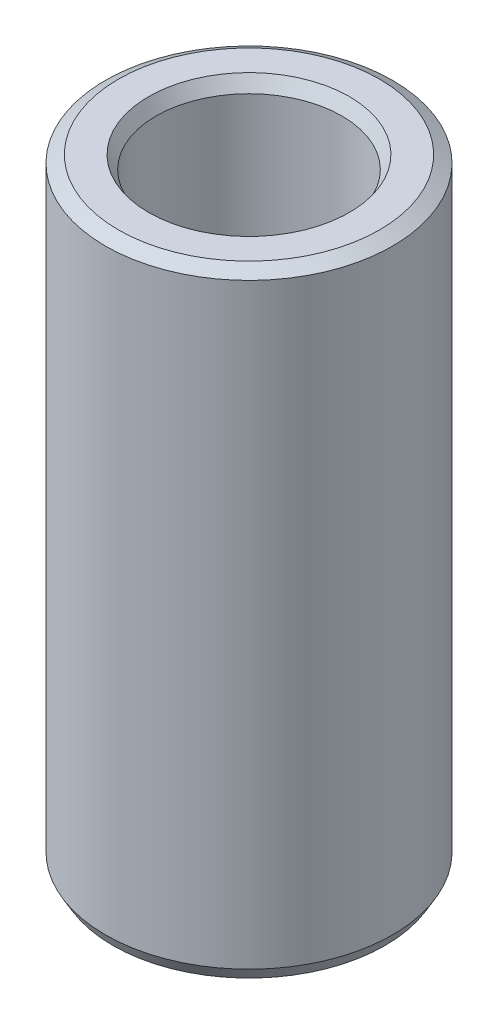
ISO-10303-21;
HEADER;
FILE_DESCRIPTION(('STEP AP214'),'2;1');
FILE_NAME('part.step','',(''),(''),'','','');
FILE_SCHEMA(('AUTOMOTIVE_DESIGN { 1 0 10303 214 1 1 1 1 }'));
ENDSEC;
DATA;
#1=APPLICATION_CONTEXT('core data for automotive mechanical design processes');
#2=APPLICATION_PROTOCOL_DEFINITION('international standard','automotive_design',2000,#1);
#3=PRODUCT_CONTEXT('',#1,'mechanical');
#4=PRODUCT('Part','Part','',(#3));
#5=PRODUCT_RELATED_PRODUCT_CATEGORY('part','',(#4));
#6=PRODUCT_DEFINITION_FORMATION('','',#4);
#7=PRODUCT_DEFINITION_CONTEXT('part definition',#1,'design');
#8=PRODUCT_DEFINITION('design','',#6,#7);
#9=PRODUCT_DEFINITION_SHAPE('','',#8);
#10=(LENGTH_UNIT() NAMED_UNIT(*) SI_UNIT(.MILLI.,.METRE.));
#11=(NAMED_UNIT(*) PLANE_ANGLE_UNIT() SI_UNIT($,.RADIAN.));
#12=(NAMED_UNIT(*) SI_UNIT($,.STERADIAN.) SOLID_ANGLE_UNIT());
#13=UNCERTAINTY_MEASURE_WITH_UNIT(LENGTH_MEASURE(1.E-05),#10,'distance_accuracy_value','');
#14=(GEOMETRIC_REPRESENTATION_CONTEXT(3) GLOBAL_UNCERTAINTY_ASSIGNED_CONTEXT((#13)) GLOBAL_UNIT_ASSIGNED_CONTEXT((#10,
#11,#12)) REPRESENTATION_CONTEXT('',''));
#15=CARTESIAN_POINT('',(0.,0.,0.));
#16=DIRECTION('',(0.,0.,1.));
#17=DIRECTION('',(1.,0.,0.));
#18=AXIS2_PLACEMENT_3D('',#15,#16,#17);
#19=CARTESIAN_POINT('',(0.,118.183043279811,0.));
#20=DIRECTION('',(0.,-1.,0.));
#21=DIRECTION('',(0.,0.,-1.));
#22=AXIS2_PLACEMENT_3D('',#19,#20,#21);
#23=CYLINDRICAL_SURFACE('',#22,27.5);
#24=CARTESIAN_POINT('',(0.,2.48997052485185,0.));
#25=DIRECTION('',(0.,1.,0.));
#26=DIRECTION('',(0.,0.,1.));
#27=AXIS2_PLACEMENT_3D('',#24,#25,#26);
#28=CIRCLE('',#27,27.5);
#29=CARTESIAN_POINT('',(0.,2.48997052485185,-27.5));
#30=VERTEX_POINT('',#29);
#31=EDGE_CURVE('E10',#30,#30,#28,.T.);
#32=CARTESIAN_POINT('',(0.,116.745458127014,0.));
#33=DIRECTION('',(0.,1.,0.));
#34=DIRECTION('',(0.,0.,1.));
#35=AXIS2_PLACEMENT_3D('',#32,#33,#34);
#36=CIRCLE('',#35,27.5);
#37=CARTESIAN_POINT('',(0.,116.745458127014,-27.5));
#38=VERTEX_POINT('',#37);
#39=EDGE_CURVE('E50',#38,#38,#36,.F.);
#40=CARTESIAN_POINT('',(0.,2.48997052485185,-27.5));
#41=CARTESIAN_POINT('',(0.,3.68013185404104,-27.5));
#42=CARTESIAN_POINT('',(0.,4.87029318323022,-27.5));
#43=CARTESIAN_POINT('',(0.,7.2506158416086,-27.5));
#44=CARTESIAN_POINT('',(0.,8.44077717079778,-27.5));
#45=CARTESIAN_POINT('',(0.,10.8210998291762,-27.5));
#46=CARTESIAN_POINT('',(0.,12.0112611583653,-27.5));
#47=CARTESIAN_POINT('',(0.,14.3915838167437,-27.5));
#48=CARTESIAN_POINT('',(0.,15.5817451459329,-27.5));
#49=CARTESIAN_POINT('',(0.,17.9620678043113,-27.5));
#50=CARTESIAN_POINT('',(0.,19.1522291335005,-27.5));
#51=CARTESIAN_POINT('',(0.,21.5325517918788,-27.5));
#52=CARTESIAN_POINT('',(0.,22.722713121068,-27.5));
#53=CARTESIAN_POINT('',(0.,25.1030357794464,-27.5));
#54=CARTESIAN_POINT('',(0.,26.2931971086356,-27.5));
#55=CARTESIAN_POINT('',(0.,28.673519767014,-27.5));
#56=CARTESIAN_POINT('',(0.,29.8636810962031,-27.5));
#57=CARTESIAN_POINT('',(0.,32.2440037545815,-27.5));
#58=CARTESIAN_POINT('',(0.,33.4341650837707,-27.5));
#59=CARTESIAN_POINT('',(0.,35.8144877421491,-27.5));
#60=CARTESIAN_POINT('',(0.,37.0046490713383,-27.5));
#61=CARTESIAN_POINT('',(0.,39.3849717297166,-27.5));
#62=CARTESIAN_POINT('',(0.,40.5751330589058,-27.5));
#63=CARTESIAN_POINT('',(0.,42.9554557172842,-27.5));
#64=CARTESIAN_POINT('',(0.,44.1456170464734,-27.5));
#65=CARTESIAN_POINT('',(0.,46.5259397048518,-27.5));
#66=CARTESIAN_POINT('',(0.,47.7161010340409,-27.5));
#67=CARTESIAN_POINT('',(0.,50.0964236924193,-27.5));
#68=CARTESIAN_POINT('',(0.,51.2865850216085,-27.5));
#69=CARTESIAN_POINT('',(0.,53.6669076799869,-27.5));
#70=CARTESIAN_POINT('',(0.,54.8570690091761,-27.5));
#71=CARTESIAN_POINT('',(0.,57.2373916675544,-27.5));
#72=CARTESIAN_POINT('',(0.,58.4275529967436,-27.5));
#73=CARTESIAN_POINT('',(0.,60.807875655122,-27.5));
#74=CARTESIAN_POINT('',(0.,61.9980369843112,-27.5));
#75=CARTESIAN_POINT('',(0.,64.3783596426895,-27.5));
#76=CARTESIAN_POINT('',(0.,65.5685209718788,-27.5));
#77=CARTESIAN_POINT('',(0.,67.9488436302571,-27.5));
#78=CARTESIAN_POINT('',(0.,69.1390049594463,-27.5));
#79=CARTESIAN_POINT('',(0.,71.5193276178247,-27.5));
#80=CARTESIAN_POINT('',(0.,72.7094889470139,-27.5));
#81=CARTESIAN_POINT('',(0.,75.0898116053922,-27.5));
#82=CARTESIAN_POINT('',(0.,76.2799729345814,-27.5));
#83=CARTESIAN_POINT('',(0.,78.6602955929598,-27.5));
#84=CARTESIAN_POINT('',(0.,79.850456922149,-27.5));
#85=CARTESIAN_POINT('',(0.,82.2307795805273,-27.5));
#86=CARTESIAN_POINT('',(0.,83.4209409097165,-27.5));
#87=CARTESIAN_POINT('',(0.,85.8012635680949,-27.5));
#88=CARTESIAN_POINT('',(0.,86.9914248972841,-27.5));
#89=CARTESIAN_POINT('',(0.,89.3717475556625,-27.5));
#90=CARTESIAN_POINT('',(0.,90.5619088848516,-27.5));
#91=CARTESIAN_POINT('',(0.,92.94223154323,-27.5));
#92=CARTESIAN_POINT('',(0.,94.1323928724192,-27.5));
#93=CARTESIAN_POINT('',(0.,96.5127155307976,-27.5));
#94=CARTESIAN_POINT('',(0.,97.7028768599868,-27.5));
#95=CARTESIAN_POINT('',(0.,100.083199518365,-27.5));
#96=CARTESIAN_POINT('',(0.,101.273360847554,-27.5));
#97=CARTESIAN_POINT('',(0.,103.653683505933,-27.5));
#98=CARTESIAN_POINT('',(0.,104.843844835122,-27.5));
#99=CARTESIAN_POINT('',(0.,107.2241674935,-27.5));
#100=CARTESIAN_POINT('',(0.,108.414328822689,-27.5));
#101=CARTESIAN_POINT('',(0.,110.794651481068,-27.5));
#102=CARTESIAN_POINT('',(0.,111.984812810257,-27.5));
#103=CARTESIAN_POINT('',(0.,114.365135468635,-27.5));
#104=CARTESIAN_POINT('',(0.,115.555296797825,-27.5));
#105=CARTESIAN_POINT('',(0.,116.745458127014,-27.5));
#106=B_SPLINE_CURVE_WITH_KNOTS('',3,(#40,#41,#42,#43,#44,#45,#46,#47,#48,#49,#50,#51,#52,#53,
#54,#55,#56,#57,#58,#59,#60,#61,#62,#63,#64,#65,#66,#67,#68,#69,#70,#71,#72,#73,#74,#75,#76,#77,
#78,#79,#80,#81,#82,#83,#84,#85,#86,#87,#88,#89,#90,#91,#92,#93,#94,#95,#96,#97,#98,#99,#100,
#101,#102,#103,#104,#105),.UNSPECIFIED.,.F.,.F.,(4,2,2,2,2,2,2,2,2,2,2,2,2,2,2,2,2,2,2,2,2,2,2,
2,2,2,2,2,2,2,2,2,4),(0.,3.57048398756755,7.14096797513512,10.7114519627027,14.2819359502702,
17.8524199378378,21.4229039254054,24.9933879129729,28.5638719005405,32.134355888108,
35.7048398756756,39.2753238632432,42.8458078508107,46.4162918383783,49.9867758259458,
53.5572598135134,57.127743801081,60.6982277886485,64.2687117762161,67.8391957637836,
71.4096797513512,74.9801637389188,78.5506477264863,82.1211317140539,85.6916157016214,
89.262099689189,92.8325836767566,96.4030676643241,99.9735516518917,103.544035639459,
107.114519627027,110.685003614594,114.255487602162),.UNSPECIFIED.);
#107=EDGE_CURVE('BSEAM39',#30,#38,#106,.T.);
#108=ORIENTED_EDGE('',*,*,#31,.T.);
#109=ORIENTED_EDGE('',*,*,#39,.T.);
#110=ORIENTED_EDGE('',*,*,#107,.T.);
#111=ORIENTED_EDGE('',*,*,#107,.F.);
#112=EDGE_LOOP('',(#108,#110,#109,#111));
#113=FACE_BOUND('',#112,.T.);
#114=ADVANCED_FACE('F39',(#113),#23,.T.);
#115=CARTESIAN_POINT('',(0.,118.183043279811,0.));
#116=DIRECTION('',(0.,1.,0.));
#117=DIRECTION('',(0.,0.,1.));
#118=AXIS2_PLACEMENT_3D('',#115,#116,#117);
#119=PLANE('',#118);
#120=CARTESIAN_POINT('',(0.,118.183043279811,0.));
#121=DIRECTION('',(0.,1.,0.));
#122=DIRECTION('',(0.,0.,1.));
#123=AXIS2_PLACEMENT_3D('',#120,#121,#122);
#124=CIRCLE('',#123,19.2276887024734);
#125=CARTESIAN_POINT('',(0.,118.183043279811,19.2276887024734));
#126=VERTEX_POINT('',#125);
#127=EDGE_CURVE('E58',#126,#126,#124,.F.);
#128=ORIENTED_EDGE('',*,*,#127,.T.);
#129=EDGE_LOOP('',(#128));
#130=FACE_BOUND('',#129,.T.);
#131=CARTESIAN_POINT('',(0.,118.183043279811,0.));
#132=DIRECTION('',(0.,1.,0.));
#133=DIRECTION('',(0.,0.,1.));
#134=AXIS2_PLACEMENT_3D('',#131,#132,#133);
#135=CIRCLE('',#134,25.0100294751485);
#136=CARTESIAN_POINT('',(0.,118.183043279811,25.0100294751485));
#137=VERTEX_POINT('',#136);
#138=EDGE_CURVE('E61',#137,#137,#135,.T.);
#139=ORIENTED_EDGE('',*,*,#138,.T.);
#140=EDGE_LOOP('',(#139));
#141=FACE_BOUND('',#140,.T.);
#142=ADVANCED_FACE('F88',(#130,#141),#119,.T.);
#143=CARTESIAN_POINT('',(0.,0.,0.));
#144=DIRECTION('',(0.,1.,0.));
#145=DIRECTION('',(0.,0.,1.));
#146=AXIS2_PLACEMENT_3D('',#143,#144,#145);
#147=PLANE('',#146);
#148=CARTESIAN_POINT('',(0.,0.,0.));
#149=DIRECTION('',(0.,1.,0.));
#150=DIRECTION('',(0.,0.,1.));
#151=AXIS2_PLACEMENT_3D('',#148,#149,#150);
#152=CIRCLE('',#151,20.2800740745276);
#153=CARTESIAN_POINT('',(0.,0.,20.2800740745276));
#154=VERTEX_POINT('',#153);
#155=EDGE_CURVE('E51',#154,#154,#152,.T.);
#156=ORIENTED_EDGE('',*,*,#155,.T.);
#157=EDGE_LOOP('',(#156));
#158=FACE_BOUND('',#157,.T.);
#159=CARTESIAN_POINT('',(0.,0.,0.));
#160=DIRECTION('',(0.,1.,0.));
#161=DIRECTION('',(0.,0.,1.));
#162=AXIS2_PLACEMENT_3D('',#159,#160,#161);
#163=CIRCLE('',#162,26.0624148472025);
#164=CARTESIAN_POINT('',(0.,0.,26.0624148472025));
#165=VERTEX_POINT('',#164);
#166=EDGE_CURVE('E54',#165,#165,#163,.F.);
#167=ORIENTED_EDGE('',*,*,#166,.T.);
#168=EDGE_LOOP('',(#167));
#169=FACE_BOUND('',#168,.T.);
#170=ADVANCED_FACE('F83',(#158,#169),#147,.F.);
#171=CARTESIAN_POINT('',(0.,118.183043279811,0.));
#172=DIRECTION('',(0.,-1.,0.));
#173=DIRECTION('',(0.,0.,-1.));
#174=AXIS2_PLACEMENT_3D('',#171,#172,#173);
#175=CYLINDRICAL_SURFACE('',#174,17.790103549676);
#176=CARTESIAN_POINT('',(0.,115.693072754959,0.));
#177=DIRECTION('',(0.,1.,0.));
#178=DIRECTION('',(0.,0.,1.));
#179=AXIS2_PLACEMENT_3D('',#176,#177,#178);
#180=CIRCLE('',#179,17.790103549676);
#181=CARTESIAN_POINT('',(0.,115.693072754959,-17.790103549676));
#182=VERTEX_POINT('',#181);
#183=EDGE_CURVE('E67',#182,#182,#180,.T.);
#184=CARTESIAN_POINT('',(0.,1.43758515279729,0.));
#185=DIRECTION('',(0.,1.,0.));
#186=DIRECTION('',(0.,0.,1.));
#187=AXIS2_PLACEMENT_3D('',#184,#185,#186);
#188=CIRCLE('',#187,17.790103549676);
#189=CARTESIAN_POINT('',(0.,1.43758515279728,-17.790103549676));
#190=VERTEX_POINT('',#189);
#191=EDGE_CURVE('E69',#190,#190,#188,.F.);
#192=CARTESIAN_POINT('',(0.,115.693072754959,-17.790103549676));
#193=CARTESIAN_POINT('',(0.,114.50291142577,-17.790103549676));
#194=CARTESIAN_POINT('',(0.,113.312750096581,-17.790103549676));
#195=CARTESIAN_POINT('',(0.,110.932427438203,-17.790103549676));
#196=CARTESIAN_POINT('',(0.,109.742266109013,-17.790103549676));
#197=CARTESIAN_POINT('',(0.,107.361943450635,-17.790103549676));
#198=CARTESIAN_POINT('',(0.,106.171782121446,-17.790103549676));
#199=CARTESIAN_POINT('',(0.,103.791459463067,-17.790103549676));
#200=CARTESIAN_POINT('',(0.,102.601298133878,-17.790103549676));
#201=CARTESIAN_POINT('',(0.,100.2209754755,-17.790103549676));
#202=CARTESIAN_POINT('',(0.,99.0308141463106,-17.790103549676));
#203=CARTESIAN_POINT('',(0.,96.6504914879323,-17.790103549676));
#204=CARTESIAN_POINT('',(0.,95.4603301587431,-17.790103549676));
#205=CARTESIAN_POINT('',(0.,93.0800075003647,-17.790103549676));
#206=CARTESIAN_POINT('',(0.,91.8898461711755,-17.790103549676));
#207=CARTESIAN_POINT('',(0.,89.5095235127971,-17.790103549676));
#208=CARTESIAN_POINT('',(0.,88.319362183608,-17.790103549676));
#209=CARTESIAN_POINT('',(0.,85.9390395252296,-17.790103549676));
#210=CARTESIAN_POINT('',(0.,84.7488781960404,-17.790103549676));
#211=CARTESIAN_POINT('',(0.,82.368555537662,-17.790103549676));
#212=CARTESIAN_POINT('',(0.,81.1783942084728,-17.790103549676));
#213=CARTESIAN_POINT('',(0.,78.7980715500944,-17.790103549676));
#214=CARTESIAN_POINT('',(0.,77.6079102209053,-17.790103549676));
#215=CARTESIAN_POINT('',(0.,75.2275875625269,-17.790103549676));
#216=CARTESIAN_POINT('',(0.,74.0374262333377,-17.790103549676));
#217=CARTESIAN_POINT('',(0.,71.6571035749594,-17.790103549676));
#218=CARTESIAN_POINT('',(0.,70.4669422457701,-17.790103549676));
#219=CARTESIAN_POINT('',(0.,68.0866195873918,-17.790103549676));
#220=CARTESIAN_POINT('',(0.,66.8964582582026,-17.790103549676));
#221=CARTESIAN_POINT('',(0.,64.5161355998242,-17.790103549676));
#222=CARTESIAN_POINT('',(0.,63.325974270635,-17.790103549676));
#223=CARTESIAN_POINT('',(0.,60.9456516122567,-17.790103549676));
#224=CARTESIAN_POINT('',(0.,59.7554902830675,-17.790103549676));
#225=CARTESIAN_POINT('',(0.,57.3751676246891,-17.790103549676));
#226=CARTESIAN_POINT('',(0.,56.1850062954999,-17.790103549676));
#227=CARTESIAN_POINT('',(0.,53.8046836371215,-17.790103549676));
#228=CARTESIAN_POINT('',(0.,52.6145223079323,-17.790103549676));
#229=CARTESIAN_POINT('',(0.,50.234199649554,-17.790103549676));
#230=CARTESIAN_POINT('',(0.,49.0440383203648,-17.790103549676));
#231=CARTESIAN_POINT('',(0.,46.6637156619864,-17.790103549676));
#232=CARTESIAN_POINT('',(0.,45.4735543327972,-17.790103549676));
#233=CARTESIAN_POINT('',(0.,43.0932316744188,-17.790103549676));
#234=CARTESIAN_POINT('',(0.,41.9030703452297,-17.790103549676));
#235=CARTESIAN_POINT('',(0.,39.5227476868513,-17.790103549676));
#236=CARTESIAN_POINT('',(0.,38.3325863576621,-17.790103549676));
#237=CARTESIAN_POINT('',(0.,35.9522636992837,-17.790103549676));
#238=CARTESIAN_POINT('',(0.,34.7621023700945,-17.790103549676));
#239=CARTESIAN_POINT('',(0.,32.3817797117161,-17.790103549676));
#240=CARTESIAN_POINT('',(0.,31.191618382527,-17.790103549676));
#241=CARTESIAN_POINT('',(0.,28.8112957241486,-17.790103549676));
#242=CARTESIAN_POINT('',(0.,27.6211343949594,-17.790103549676));
#243=CARTESIAN_POINT('',(0.,25.240811736581,-17.790103549676));
#244=CARTESIAN_POINT('',(0.,24.0506504073918,-17.790103549676));
#245=CARTESIAN_POINT('',(0.,21.6703277490135,-17.790103549676));
#246=CARTESIAN_POINT('',(0.,20.4801664198243,-17.790103549676));
#247=CARTESIAN_POINT('',(0.,18.0998437614459,-17.790103549676));
#248=CARTESIAN_POINT('',(0.,16.9096824322567,-17.790103549676));
#249=CARTESIAN_POINT('',(0.,14.5293597738783,-17.790103549676));
#250=CARTESIAN_POINT('',(0.,13.3391984446892,-17.790103549676));
#251=CARTESIAN_POINT('',(0.,10.9588757863108,-17.790103549676));
#252=CARTESIAN_POINT('',(0.,9.76871445712159,-17.790103549676));
#253=CARTESIAN_POINT('',(0.,7.38839179874322,-17.790103549676));
#254=CARTESIAN_POINT('',(0.,6.19823046955403,-17.790103549676));
#255=CARTESIAN_POINT('',(0.,3.81790781117566,-17.790103549676));
#256=CARTESIAN_POINT('',(0.,2.62774648198647,-17.790103549676));
#257=CARTESIAN_POINT('',(0.,1.43758515279728,-17.790103549676));
#258=B_SPLINE_CURVE_WITH_KNOTS('',3,(#192,#193,#194,#195,#196,#197,#198,#199,#200,#201,#202,
#203,#204,#205,#206,#207,#208,#209,#210,#211,#212,#213,#214,#215,#216,#217,#218,#219,#220,#221,
#222,#223,#224,#225,#226,#227,#228,#229,#230,#231,#232,#233,#234,#235,#236,#237,#238,#239,#240,
#241,#242,#243,#244,#245,#246,#247,#248,#249,#250,#251,#252,#253,#254,#255,#256,#257),
.UNSPECIFIED.,.F.,.F.,(4,2,2,2,2,2,2,2,2,2,2,2,2,2,2,2,2,2,2,2,2,2,2,2,2,2,2,2,2,2,2,2,4),(0.,
3.57048398756755,7.14096797513512,10.7114519627027,14.2819359502702,17.8524199378378,
21.4229039254054,24.9933879129729,28.5638719005405,32.134355888108,35.7048398756756,
39.2753238632432,42.8458078508107,46.4162918383783,49.9867758259459,53.5572598135134,
57.127743801081,60.6982277886485,64.2687117762161,67.8391957637837,71.4096797513512,
74.9801637389188,78.5506477264864,82.1211317140539,85.6916157016215,89.262099689189,
92.8325836767566,96.4030676643242,99.9735516518917,103.544035639459,107.114519627027,
110.685003614594,114.255487602162),.UNSPECIFIED.);
#259=EDGE_CURVE('BSEAM71',#182,#190,#258,.T.);
#260=ORIENTED_EDGE('',*,*,#183,.T.);
#261=ORIENTED_EDGE('',*,*,#191,.T.);
#262=ORIENTED_EDGE('',*,*,#259,.T.);
#263=ORIENTED_EDGE('',*,*,#259,.F.);
#264=EDGE_LOOP('',(#260,#262,#261,#263));
#265=FACE_BOUND('',#264,.T.);
#266=ADVANCED_FACE('F71',(#265),#175,.F.);
#267=CARTESIAN_POINT('',(0.,115.693072754959,0.));
#268=DIRECTION('',(0.,1.,0.));
#269=DIRECTION('',(0.,0.,1.));
#270=AXIS2_PLACEMENT_3D('',#267,#268,#269);
#271=CONICAL_SURFACE('',#270,17.790103549676,0.523598775598297);
#272=ORIENTED_EDGE('',*,*,#127,.F.);
#273=EDGE_LOOP('',(#272));
#274=FACE_BOUND('',#273,.T.);
#275=ORIENTED_EDGE('',*,*,#183,.F.);
#276=EDGE_LOOP('',(#275));
#277=FACE_BOUND('',#276,.T.);
#278=ADVANCED_FACE('F77',(#274,#277),#271,.F.);
#279=CARTESIAN_POINT('',(0.,0.,0.));
#280=DIRECTION('',(0.,-1.,0.));
#281=DIRECTION('',(0.,0.,-1.));
#282=AXIS2_PLACEMENT_3D('',#279,#280,#281);
#283=CONICAL_SURFACE('',#282,20.2800740745276,1.0471975511966);
#284=ORIENTED_EDGE('',*,*,#191,.F.);
#285=EDGE_LOOP('',(#284));
#286=FACE_BOUND('',#285,.T.);
#287=ORIENTED_EDGE('',*,*,#155,.F.);
#288=EDGE_LOOP('',(#287));
#289=FACE_BOUND('',#288,.T.);
#290=ADVANCED_FACE('F73',(#286,#289),#283,.F.);
#291=CARTESIAN_POINT('',(0.,2.48997052485185,0.));
#292=DIRECTION('',(0.,1.,0.));
#293=DIRECTION('',(0.,0.,1.));
#294=AXIS2_PLACEMENT_3D('',#291,#292,#293);
#295=CONICAL_SURFACE('',#294,27.5,0.523598775598302);
#296=ORIENTED_EDGE('',*,*,#166,.F.);
#297=EDGE_LOOP('',(#296));
#298=FACE_BOUND('',#297,.T.);
#299=ORIENTED_EDGE('',*,*,#31,.F.);
#300=EDGE_LOOP('',(#299));
#301=FACE_BOUND('',#300,.T.);
#302=ADVANCED_FACE('F76',(#298,#301),#295,.T.);
#303=CARTESIAN_POINT('',(0.,118.183043279811,0.));
#304=DIRECTION('',(0.,-1.,0.));
#305=DIRECTION('',(0.,0.,-1.));
#306=AXIS2_PLACEMENT_3D('',#303,#304,#305);
#307=CONICAL_SURFACE('',#306,25.0100294751485,1.0471975511966);
#308=ORIENTED_EDGE('',*,*,#39,.F.);
#309=EDGE_LOOP('',(#308));
#310=FACE_BOUND('',#309,.T.);
#311=ORIENTED_EDGE('',*,*,#138,.F.);
#312=EDGE_LOOP('',(#311));
#313=FACE_BOUND('',#312,.T.);
#314=ADVANCED_FACE('F45',(#310,#313),#307,.T.);
#315=CLOSED_SHELL('',(#114,#142,#170,#266,#278,#290,#302,#314));
#316=MANIFOLD_SOLID_BREP('B2',#315);
#317=ADVANCED_BREP_SHAPE_REPRESENTATION('',(#18,#316),#14);
#318=SHAPE_DEFINITION_REPRESENTATION(#9,#317);
ENDSEC;
END-ISO-10303-21;
